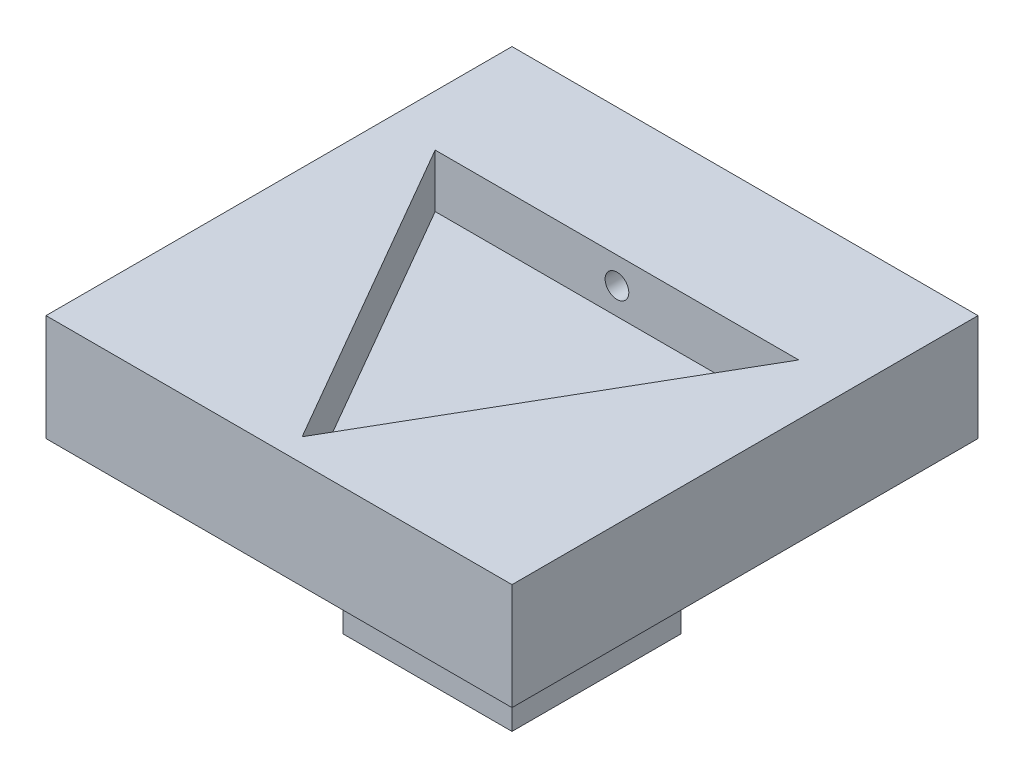
ISO-10303-21;
HEADER;
FILE_DESCRIPTION(('STEP AP214'),'2;1');
FILE_NAME('part.step','',(''),(''),'','','');
FILE_SCHEMA(('AUTOMOTIVE_DESIGN { 1 0 10303 214 1 1 1 1 }'));
ENDSEC;
DATA;
#1=APPLICATION_CONTEXT('core data for automotive mechanical design processes');
#2=APPLICATION_PROTOCOL_DEFINITION('international standard','automotive_design',2000,#1);
#3=PRODUCT_CONTEXT('',#1,'mechanical');
#4=PRODUCT('Part','Part','',(#3));
#5=PRODUCT_RELATED_PRODUCT_CATEGORY('part','',(#4));
#6=PRODUCT_DEFINITION_FORMATION('','',#4);
#7=PRODUCT_DEFINITION_CONTEXT('part definition',#1,'design');
#8=PRODUCT_DEFINITION('design','',#6,#7);
#9=PRODUCT_DEFINITION_SHAPE('','',#8);
#10=(LENGTH_UNIT() NAMED_UNIT(*) SI_UNIT(.MILLI.,.METRE.));
#11=(NAMED_UNIT(*) PLANE_ANGLE_UNIT() SI_UNIT($,.RADIAN.));
#12=(NAMED_UNIT(*) SI_UNIT($,.STERADIAN.) SOLID_ANGLE_UNIT());
#13=UNCERTAINTY_MEASURE_WITH_UNIT(LENGTH_MEASURE(1.E-05),#10,'distance_accuracy_value','');
#14=(GEOMETRIC_REPRESENTATION_CONTEXT(3) GLOBAL_UNCERTAINTY_ASSIGNED_CONTEXT((#13)) GLOBAL_UNIT_ASSIGNED_CONTEXT((#10,
#11,#12)) REPRESENTATION_CONTEXT('',''));
#15=CARTESIAN_POINT('',(0.,0.,0.));
#16=DIRECTION('',(0.,0.,1.));
#17=DIRECTION('',(1.,0.,0.));
#18=AXIS2_PLACEMENT_3D('',#15,#16,#17);
#19=CARTESIAN_POINT('',(0.,-6.35,6.35));
#20=DIRECTION('',(0.,0.,1.));
#21=DIRECTION('',(1.,0.,0.));
#22=AXIS2_PLACEMENT_3D('',#19,#20,#21);
#23=CYLINDRICAL_SURFACE('',#22,3.17499999999999);
#24=CARTESIAN_POINT('',(0.,-6.35,6.35));
#25=DIRECTION('',(0.,0.,1.));
#26=DIRECTION('',(1.,0.,0.));
#27=AXIS2_PLACEMENT_3D('',#24,#25,#26);
#28=CIRCLE('',#27,3.17499999999999);
#29=CARTESIAN_POINT('',(3.17499999999999,-6.35,6.35));
#30=VERTEX_POINT('',#29);
#31=EDGE_CURVE('E188',#30,#30,#28,.T.);
#32=ORIENTED_EDGE('',*,*,#31,.T.);
#33=EDGE_LOOP('',(#32));
#34=FACE_BOUND('',#33,.T.);
#35=CARTESIAN_POINT('',(0.,-9.52499999999999,-0.888999999999992));
#36=CARTESIAN_POINT('',(-0.0489157737538349,-9.52499936518856,-0.888999040755593));
#37=CARTESIAN_POINT('',(-0.0978415218299255,-9.52385856149938,-0.884949249649737));
#38=CARTESIAN_POINT('',(-0.194277613152042,-9.51941869982884,-0.868889515030162));
#39=CARTESIAN_POINT('',(-0.241787368037372,-9.51611875742133,-0.856876309517103));
#40=CARTESIAN_POINT('',(-0.333985970836094,-9.50772382932597,-0.825315435182667));
#41=CARTESIAN_POINT('',(-0.378678565700526,-9.50263128992257,-0.805778030929362));
#42=CARTESIAN_POINT('',(-0.464153150691927,-9.49118589033194,-0.759762993139136));
#43=CARTESIAN_POINT('',(-0.504934775786131,-9.48483291267041,-0.733284712630688));
#44=CARTESIAN_POINT('',(-0.582463324273018,-9.47136930906929,-0.673431529821144));
#45=CARTESIAN_POINT('',(-0.619097040879819,-9.46424471003711,-0.639913133891119));
#46=CARTESIAN_POINT('',(-0.686303745395539,-9.45012804899673,-0.567237555679335));
#47=CARTESIAN_POINT('',(-0.716875865353098,-9.44313600609849,-0.528079567256226));
#48=CARTESIAN_POINT('',(-0.771660273705076,-9.42993134711161,-0.444311833340359));
#49=CARTESIAN_POINT('',(-0.795739269537287,-9.42373626155938,-0.399611894550792));
#50=CARTESIAN_POINT('',(-0.83599419308683,-9.41303372841594,-0.306596224568229));
#51=CARTESIAN_POINT('',(-0.852171745640045,-9.4085259338984,-0.258281239124241));
#52=CARTESIAN_POINT('',(-0.875765553832272,-9.40185316306031,-0.160667772584882));
#53=CARTESIAN_POINT('',(-0.883388435468438,-9.39963304486603,-0.111423099155392));
#54=CARTESIAN_POINT('',(-0.890301136120377,-9.39762251150206,-0.0123076734273206));
#55=CARTESIAN_POINT('',(-0.889592686927827,-9.39783159138712,0.0375629466060269));
#56=CARTESIAN_POINT('',(-0.880026195745615,-9.40060666415035,0.134876354240687));
#57=CARTESIAN_POINT('',(-0.871421512477304,-9.4030993800786,0.182346475695469));
#58=CARTESIAN_POINT('',(-0.846713969112871,-9.41004305828935,0.275140646535334));
#59=CARTESIAN_POINT('',(-0.830610455225383,-9.4144941913161,0.320464508417443));
#60=CARTESIAN_POINT('',(-0.791163712285423,-9.42491527179748,0.408324147300476));
#61=CARTESIAN_POINT('',(-0.767734261578664,-9.43090314682857,0.450818996368115));
#62=CARTESIAN_POINT('',(-0.71436077007306,-9.44371379002513,0.53136139317462));
#63=CARTESIAN_POINT('',(-0.684415329838213,-9.45053673740076,0.569407982860276));
#64=CARTESIAN_POINT('',(-0.617578797379297,-9.46455075820432,0.641417476103654));
#65=CARTESIAN_POINT('',(-0.580475883052368,-9.471746226402,0.675183219833241));
#66=CARTESIAN_POINT('',(-0.501045351949352,-9.48547454789475,0.736055887562636));
#67=CARTESIAN_POINT('',(-0.458717485449023,-9.49200736949173,0.763162493106644));
#68=CARTESIAN_POINT('',(-0.36971285397413,-9.50372159534797,0.810046721230191));
#69=CARTESIAN_POINT('',(-0.323014650586869,-9.50889580695916,0.829785561102166));
#70=CARTESIAN_POINT('',(-0.226783977774734,-9.5172579589955,0.861073826594334));
#71=CARTESIAN_POINT('',(-0.177252196580579,-9.52044637951993,0.872625231761535));
#72=CARTESIAN_POINT('',(-0.0784404499677195,-9.52440379725835,0.886893968773622));
#73=CARTESIAN_POINT('',(-0.0292020197379107,-9.52524608915643,0.889879012949531));
#74=CARTESIAN_POINT('',(0.0690730306447958,-9.52462873659144,0.887673884327845));
#75=CARTESIAN_POINT('',(0.11810967332519,-9.52316935648366,0.882484650375492));
#76=CARTESIAN_POINT('',(0.213612420430054,-9.51816025342918,0.864296763280251));
#77=CARTESIAN_POINT('',(0.260109821187467,-9.51465126206611,0.851450184145278));
#78=CARTESIAN_POINT('',(0.350282967028205,-9.50594369765461,0.818491325090642));
#79=CARTESIAN_POINT('',(0.393958390904348,-9.50074493267499,0.798378219781215));
#80=CARTESIAN_POINT('',(0.478266796673957,-9.48906619959135,0.750979145328022));
#81=CARTESIAN_POINT('',(0.518816442059783,-9.48256157871768,0.72355117680334));
#82=CARTESIAN_POINT('',(0.594830571157073,-9.46902144731137,0.662477080624359));
#83=CARTESIAN_POINT('',(0.630293941475874,-9.46198582105379,0.628829595187419));
#84=CARTESIAN_POINT('',(0.696277111843979,-9.44790229776669,0.555018170335194));
#85=CARTESIAN_POINT('',(0.726607293994759,-9.4408609178264,0.514683143208387));
#86=CARTESIAN_POINT('',(0.780076249197734,-9.42780220325433,0.429344769891043));
#87=CARTESIAN_POINT('',(0.803215290960614,-9.42178483036237,0.384341598218469));
#88=CARTESIAN_POINT('',(0.841473857948888,-9.41152566127488,0.291144664224763));
#89=CARTESIAN_POINT('',(0.856637385143015,-9.4072741505467,0.242970094043794));
#90=CARTESIAN_POINT('',(0.878604076191613,-9.40103470564522,0.144613537966147));
#91=CARTESIAN_POINT('',(0.885409649014228,-9.39904611925357,0.0944321347958804));
#92=CARTESIAN_POINT('',(0.890318537347577,-9.39761603869309,-0.00456168626051117));
#93=CARTESIAN_POINT('',(0.888728204509423,-9.39808487304596,-0.0533578331874128));
#94=CARTESIAN_POINT('',(0.877609048522053,-9.40130466354991,-0.149956476607359));
#95=CARTESIAN_POINT('',(0.868080470943479,-9.40405554910543,-0.197759003791274));
#96=CARTESIAN_POINT('',(0.841541065868853,-9.4114733946758,-0.290583490313341));
#97=CARTESIAN_POINT('',(0.82460142237537,-9.41612209823446,-0.335627365346018));
#98=CARTESIAN_POINT('',(0.783775785662911,-9.42681065069981,-0.422268905257553));
#99=CARTESIAN_POINT('',(0.759888604353119,-9.43285073750866,-0.463865979138124));
#100=CARTESIAN_POINT('',(0.704944037229975,-9.44588424541817,-0.54387986720024));
#101=CARTESIAN_POINT('',(0.673680626237007,-9.45290209243823,-0.582151239273038));
#102=CARTESIAN_POINT('',(0.605254714532238,-9.46697124976765,-0.653003971391015));
#103=CARTESIAN_POINT('',(0.56809074717124,-9.4740225679728,-0.685583912527643));
#104=CARTESIAN_POINT('',(0.487828859115458,-9.48756945243036,-0.74491222597394));
#105=CARTESIAN_POINT('',(0.444608622335945,-9.4940473358147,-0.771499534501301));
#106=CARTESIAN_POINT('',(0.354130776281862,-9.50551736196214,-0.816990118054409));
#107=CARTESIAN_POINT('',(0.306875512094534,-9.51051036025106,-0.835897820039279));
#108=CARTESIAN_POINT('',(0.216568135388876,-9.51788227398237,-0.863320172720964));
#109=CARTESIAN_POINT('',(0.173866502868503,-9.52053098906547,-0.872926353200924));
#110=CARTESIAN_POINT('',(0.0874458203594981,-9.52409002955724,-0.885766306093223));
#111=CARTESIAN_POINT('',(0.0437268954046199,-9.52500056747201,-0.889000857489842));
#112=CARTESIAN_POINT('',(0.,-9.52499999999999,-0.888999999999992));
#113=B_SPLINE_CURVE_WITH_KNOTS('',3,(#35,#36,#37,#38,#39,#40,#41,#42,#43,#44,#45,#46,#47,#48,
#49,#50,#51,#52,#53,#54,#55,#56,#57,#58,#59,#60,#61,#62,#63,#64,#65,#66,#67,#68,#69,#70,#71,#72,
#73,#74,#75,#76,#77,#78,#79,#80,#81,#82,#83,#84,#85,#86,#87,#88,#89,#90,#91,#92,#93,#94,#95,#96,
#97,#98,#99,#100,#101,#102,#103,#104,#105,#106,#107,#108,#109,#110,#111,#112),.UNSPECIFIED.,.T.,
.F.,(4,2,2,2,2,2,2,2,2,2,2,2,2,2,2,2,2,2,2,2,2,2,2,2,2,2,2,2,2,2,2,2,2,2,2,2,2,2,4),(0.,
0.146586863750049,0.293233810016137,0.439681404062497,0.586142653608805,0.735943608929927,
0.885765998569633,1.03846326158801,1.1911291110338,1.34002235519436,1.48888465021512,
1.6331314778207,1.77739088405319,1.92341644964252,2.06947340808293,2.22080635932415,
2.37214654625826,2.52427248983089,2.67636164003823,2.82364307680308,2.97090759899851,
3.11534059337545,3.25978999875986,3.40727830060936,3.55479883873722,3.70693967387801,
3.85907482330245,4.01036157739037,4.16160471667115,4.30736828106396,4.45312733640924,
4.5975160871541,4.74192954419325,4.89099085253725,5.04008926990668,5.19281316203592,
5.34544889010499,5.47650216312912,5.60753941281356),.UNSPECIFIED.);
#114=CARTESIAN_POINT('',(-0.628617928474835,-9.46214789173008,0.628617928474835));
#115=VERTEX_POINT('',#114);
#116=CARTESIAN_POINT('',(0.628617928474841,-9.46214789173008,0.628617928474839));
#117=VERTEX_POINT('',#116);
#118=EDGE_CURVE('E145',#115,#117,#113,.T.);
#119=ORIENTED_EDGE('',*,*,#118,.F.);
#120=CARTESIAN_POINT('',(0.,-6.35,0.));
#121=DIRECTION('',(0.707106781186547,0.,0.707106781186547));
#122=DIRECTION('',(-0.707106781186547,0.,0.707106781186547));
#123=AXIS2_PLACEMENT_3D('',#120,#121,#122);
#124=ELLIPSE('',#123,4.49012806053456,3.17499999999999);
#125=CARTESIAN_POINT('',(0.,-3.17500000000001,0.));
#126=VERTEX_POINT('',#125);
#127=EDGE_CURVE('E43',#115,#126,#124,.F.);
#128=ORIENTED_EDGE('',*,*,#127,.T.);
#129=CARTESIAN_POINT('',(0.,-6.35,0.));
#130=DIRECTION('',(-0.707106781186547,0.,0.707106781186547));
#131=DIRECTION('',(0.707106781186547,0.,0.707106781186547));
#132=AXIS2_PLACEMENT_3D('',#129,#130,#131);
#133=ELLIPSE('',#132,4.49012806053456,3.17499999999999);
#134=EDGE_CURVE('E150',#126,#117,#133,.F.);
#135=ORIENTED_EDGE('',*,*,#134,.T.);
#136=EDGE_LOOP('',(#119,#128,#135));
#137=FACE_BOUND('',#136,.T.);
#138=ADVANCED_FACE('F31',(#34,#137),#23,.F.);
#139=CARTESIAN_POINT('',(17.5,0.,-17.5));
#140=DIRECTION('',(0.,-1.,0.));
#141=DIRECTION('',(0.,0.,-1.));
#142=AXIS2_PLACEMENT_3D('',#139,#140,#141);
#143=PLANE('',#142);
#144=DIRECTION('',(0.,0.,-1.));
#145=VECTOR('',#144,1.);
#146=CARTESIAN_POINT('',(17.5,0.,17.5));
#147=LINE('',#146,#145);
#148=CARTESIAN_POINT('',(17.5,0.,17.5));
#149=VERTEX_POINT('',#148);
#150=CARTESIAN_POINT('',(17.5,0.,-17.5));
#151=VERTEX_POINT('',#150);
#152=EDGE_CURVE('E245',#149,#151,#147,.T.);
#153=ORIENTED_EDGE('',*,*,#152,.F.);
#154=DIRECTION('',(1.,0.,0.));
#155=VECTOR('',#154,1.);
#156=CARTESIAN_POINT('',(-17.5,0.,17.5));
#157=LINE('',#156,#155);
#158=CARTESIAN_POINT('',(-17.5,0.,17.5));
#159=VERTEX_POINT('',#158);
#160=EDGE_CURVE('E254',#159,#149,#157,.T.);
#161=ORIENTED_EDGE('',*,*,#160,.F.);
#162=DIRECTION('',(0.,0.,1.));
#163=VECTOR('',#162,1.);
#164=CARTESIAN_POINT('',(-17.5,0.,17.5));
#165=LINE('',#164,#163);
#166=CARTESIAN_POINT('',(-17.5,0.,-17.5));
#167=VERTEX_POINT('',#166);
#168=EDGE_CURVE('E265',#167,#159,#165,.T.);
#169=ORIENTED_EDGE('',*,*,#168,.F.);
#170=DIRECTION('',(-1.,0.,0.));
#171=VECTOR('',#170,1.);
#172=CARTESIAN_POINT('',(-17.5,0.,-17.5));
#173=LINE('',#172,#171);
#174=EDGE_CURVE('E263',#151,#167,#173,.T.);
#175=ORIENTED_EDGE('',*,*,#174,.F.);
#176=EDGE_LOOP('',(#153,#161,#169,#175));
#177=FACE_BOUND('',#176,.T.);
#178=DIRECTION('',(-1.,0.,0.));
#179=VECTOR('',#178,1.);
#180=CARTESIAN_POINT('',(-6.35,0.,6.35));
#181=LINE('',#180,#179);
#182=CARTESIAN_POINT('',(6.35,0.,6.35));
#183=VERTEX_POINT('',#182);
#184=CARTESIAN_POINT('',(-6.35,0.,6.35));
#185=VERTEX_POINT('',#184);
#186=EDGE_CURVE('E206',#183,#185,#181,.T.);
#187=ORIENTED_EDGE('',*,*,#186,.F.);
#188=DIRECTION('',(0.,0.,1.));
#189=VECTOR('',#188,1.);
#190=CARTESIAN_POINT('',(6.35,0.,-6.35));
#191=LINE('',#190,#189);
#192=CARTESIAN_POINT('',(6.35,0.,-6.35));
#193=VERTEX_POINT('',#192);
#194=EDGE_CURVE('E203',#193,#183,#191,.T.);
#195=ORIENTED_EDGE('',*,*,#194,.F.);
#196=DIRECTION('',(1.,0.,0.));
#197=VECTOR('',#196,1.);
#198=CARTESIAN_POINT('',(-6.35,0.,-6.35));
#199=LINE('',#198,#197);
#200=CARTESIAN_POINT('',(-6.35,0.,-6.35));
#201=VERTEX_POINT('',#200);
#202=EDGE_CURVE('E196',#201,#193,#199,.T.);
#203=ORIENTED_EDGE('',*,*,#202,.F.);
#204=DIRECTION('',(0.,0.,-1.));
#205=VECTOR('',#204,1.);
#206=CARTESIAN_POINT('',(-6.35,0.,-6.35));
#207=LINE('',#206,#205);
#208=EDGE_CURVE('E208',#185,#201,#207,.T.);
#209=ORIENTED_EDGE('',*,*,#208,.F.);
#210=EDGE_LOOP('',(#187,#195,#203,#209));
#211=FACE_BOUND('',#210,.T.);
#212=ADVANCED_FACE('F293',(#177,#211),#143,.T.);
#213=CARTESIAN_POINT('',(-17.5,8.,-17.5));
#214=DIRECTION('',(0.,0.,1.));
#215=DIRECTION('',(1.,0.,0.));
#216=AXIS2_PLACEMENT_3D('',#213,#214,#215);
#217=PLANE('',#216);
#218=ORIENTED_EDGE('',*,*,#174,.T.);
#219=DIRECTION('',(0.,-1.,0.));
#220=VECTOR('',#219,1.);
#221=CARTESIAN_POINT('',(-17.5,8.,-17.5));
#222=LINE('',#221,#220);
#223=CARTESIAN_POINT('',(-17.5,8.,-17.5));
#224=VERTEX_POINT('',#223);
#225=EDGE_CURVE('E273',#224,#167,#222,.T.);
#226=ORIENTED_EDGE('',*,*,#225,.F.);
#227=DIRECTION('',(-1.,0.,0.));
#228=VECTOR('',#227,1.);
#229=CARTESIAN_POINT('',(-17.5,8.,-17.5));
#230=LINE('',#229,#228);
#231=CARTESIAN_POINT('',(17.5,8.,-17.5));
#232=VERTEX_POINT('',#231);
#233=EDGE_CURVE('E253',#232,#224,#230,.T.);
#234=ORIENTED_EDGE('',*,*,#233,.F.);
#235=DIRECTION('',(0.,-1.,0.));
#236=VECTOR('',#235,1.);
#237=CARTESIAN_POINT('',(17.5,8.,-17.5));
#238=LINE('',#237,#236);
#239=EDGE_CURVE('E154',#232,#151,#238,.T.);
#240=ORIENTED_EDGE('',*,*,#239,.T.);
#241=EDGE_LOOP('',(#218,#226,#234,#240));
#242=FACE_BOUND('',#241,.T.);
#243=CARTESIAN_POINT('',(0.,6.,-17.5));
#244=DIRECTION('',(0.,0.,-1.));
#245=DIRECTION('',(-1.,0.,0.));
#246=AXIS2_PLACEMENT_3D('',#243,#244,#245);
#247=CIRCLE('',#246,0.888999999999987);
#248=CARTESIAN_POINT('',(-0.888999999999987,6.,-17.5));
#249=VERTEX_POINT('',#248);
#250=EDGE_CURVE('E219',#249,#249,#247,.T.);
#251=ORIENTED_EDGE('',*,*,#250,.F.);
#252=EDGE_LOOP('',(#251));
#253=FACE_BOUND('',#252,.T.);
#254=ADVANCED_FACE('F298',(#242,#253),#217,.F.);
#255=CARTESIAN_POINT('',(17.5,8.,17.5));
#256=DIRECTION('',(-1.,0.,0.));
#257=DIRECTION('',(0.,0.,1.));
#258=AXIS2_PLACEMENT_3D('',#255,#256,#257);
#259=PLANE('',#258);
#260=ORIENTED_EDGE('',*,*,#152,.T.);
#261=ORIENTED_EDGE('',*,*,#239,.F.);
#262=DIRECTION('',(0.,0.,-1.));
#263=VECTOR('',#262,1.);
#264=CARTESIAN_POINT('',(17.5,8.,17.5));
#265=LINE('',#264,#263);
#266=CARTESIAN_POINT('',(17.5,8.,17.5));
#267=VERTEX_POINT('',#266);
#268=EDGE_CURVE('E250',#267,#232,#265,.T.);
#269=ORIENTED_EDGE('',*,*,#268,.F.);
#270=DIRECTION('',(0.,-1.,0.));
#271=VECTOR('',#270,1.);
#272=CARTESIAN_POINT('',(17.5,8.,17.5));
#273=LINE('',#272,#271);
#274=EDGE_CURVE('E260',#267,#149,#273,.T.);
#275=ORIENTED_EDGE('',*,*,#274,.T.);
#276=EDGE_LOOP('',(#260,#261,#269,#275));
#277=FACE_BOUND('',#276,.T.);
#278=ADVANCED_FACE('F361',(#277),#259,.F.);
#279=CARTESIAN_POINT('',(-17.5,8.,17.5));
#280=DIRECTION('',(1.,0.,0.));
#281=DIRECTION('',(0.,0.,-1.));
#282=AXIS2_PLACEMENT_3D('',#279,#280,#281);
#283=PLANE('',#282);
#284=ORIENTED_EDGE('',*,*,#168,.T.);
#285=DIRECTION('',(0.,-1.,0.));
#286=VECTOR('',#285,1.);
#287=CARTESIAN_POINT('',(-17.5,8.,17.5));
#288=LINE('',#287,#286);
#289=CARTESIAN_POINT('',(-17.5,8.,17.5));
#290=VERTEX_POINT('',#289);
#291=EDGE_CURVE('E270',#290,#159,#288,.T.);
#292=ORIENTED_EDGE('',*,*,#291,.F.);
#293=DIRECTION('',(0.,0.,1.));
#294=VECTOR('',#293,1.);
#295=CARTESIAN_POINT('',(-17.5,8.,17.5));
#296=LINE('',#295,#294);
#297=EDGE_CURVE('E256',#224,#290,#296,.T.);
#298=ORIENTED_EDGE('',*,*,#297,.F.);
#299=ORIENTED_EDGE('',*,*,#225,.T.);
#300=EDGE_LOOP('',(#284,#292,#298,#299));
#301=FACE_BOUND('',#300,.T.);
#302=ADVANCED_FACE('F357',(#301),#283,.F.);
#303=CARTESIAN_POINT('',(-17.5,8.,17.5));
#304=DIRECTION('',(0.,0.,-1.));
#305=DIRECTION('',(-1.,0.,0.));
#306=AXIS2_PLACEMENT_3D('',#303,#304,#305);
#307=PLANE('',#306);
#308=ORIENTED_EDGE('',*,*,#160,.T.);
#309=ORIENTED_EDGE('',*,*,#274,.F.);
#310=DIRECTION('',(1.,0.,0.));
#311=VECTOR('',#310,1.);
#312=CARTESIAN_POINT('',(-17.5,8.,17.5));
#313=LINE('',#312,#311);
#314=EDGE_CURVE('E258',#290,#267,#313,.T.);
#315=ORIENTED_EDGE('',*,*,#314,.F.);
#316=ORIENTED_EDGE('',*,*,#291,.T.);
#317=EDGE_LOOP('',(#308,#309,#315,#316));
#318=FACE_BOUND('',#317,.T.);
#319=ADVANCED_FACE('F352',(#318),#307,.F.);
#320=CARTESIAN_POINT('',(17.5,8.,-17.5));
#321=DIRECTION('',(0.,-1.,0.));
#322=DIRECTION('',(0.,0.,-1.));
#323=AXIS2_PLACEMENT_3D('',#320,#321,#322);
#324=PLANE('',#323);
#325=DIRECTION('',(0.500000000000099,0.,-0.866025403784381));
#326=VECTOR('',#325,1.);
#327=CARTESIAN_POINT('',(-1.80110809081765E-12,8.,15.7640191786544));
#328=LINE('',#327,#326);
#329=CARTESIAN_POINT('',(-1.80064296806393E-12,8.,15.7640191786544));
#330=VERTEX_POINT('',#329);
#331=CARTESIAN_POINT('',(13.6520410744607,8.,-7.88200958932565));
#332=VERTEX_POINT('',#331);
#333=EDGE_CURVE('E238',#330,#332,#328,.T.);
#334=ORIENTED_EDGE('',*,*,#333,.F.);
#335=DIRECTION('',(0.499999999999901,0.,0.866025403784496));
#336=VECTOR('',#335,1.);
#337=CARTESIAN_POINT('',(-13.6520410744589,8.,-7.88200958932876));
#338=LINE('',#337,#336);
#339=CARTESIAN_POINT('',(-13.6520410744589,8.,-7.88200958932876));
#340=VERTEX_POINT('',#339);
#341=EDGE_CURVE('E225',#340,#330,#338,.T.);
#342=ORIENTED_EDGE('',*,*,#341,.F.);
#343=DIRECTION('',(-1.,0.,-1.13915537444627E-13));
#344=VECTOR('',#343,1.);
#345=CARTESIAN_POINT('',(13.6520410744607,8.,-7.88200958932565));
#346=LINE('',#345,#344);
#347=EDGE_CURVE('E230',#332,#340,#346,.T.);
#348=ORIENTED_EDGE('',*,*,#347,.F.);
#349=EDGE_LOOP('',(#334,#342,#348));
#350=FACE_BOUND('',#349,.T.);
#351=ORIENTED_EDGE('',*,*,#268,.T.);
#352=ORIENTED_EDGE('',*,*,#233,.T.);
#353=ORIENTED_EDGE('',*,*,#297,.T.);
#354=ORIENTED_EDGE('',*,*,#314,.T.);
#355=EDGE_LOOP('',(#351,#352,#353,#354));
#356=FACE_BOUND('',#355,.T.);
#357=ADVANCED_FACE('F349',(#350,#356),#324,.F.);
#358=CARTESIAN_POINT('',(-13.6520410744589,4.,-7.88200958932876));
#359=DIRECTION('',(-0.866025403784496,0.,0.499999999999901));
#360=DIRECTION('',(0.499999999999901,0.,0.866025403784496));
#361=AXIS2_PLACEMENT_3D('',#358,#359,#360);
#362=PLANE('',#361);
#363=ORIENTED_EDGE('',*,*,#341,.T.);
#364=DIRECTION('',(0.,1.,0.));
#365=VECTOR('',#364,1.);
#366=CARTESIAN_POINT('',(-1.80110809081765E-12,4.,15.7640191786544));
#367=LINE('',#366,#365);
#368=CARTESIAN_POINT('',(-1.80110809081765E-12,4.,15.7640191786544));
#369=VERTEX_POINT('',#368);
#370=EDGE_CURVE('E236',#369,#330,#367,.T.);
#371=ORIENTED_EDGE('',*,*,#370,.F.);
#372=DIRECTION('',(0.499999999999901,0.,0.866025403784496));
#373=VECTOR('',#372,1.);
#374=CARTESIAN_POINT('',(-13.6520410744589,4.,-7.88200958932876));
#375=LINE('',#374,#373);
#376=CARTESIAN_POINT('',(-13.6520410744589,4.,-7.88200958932876));
#377=VERTEX_POINT('',#376);
#378=EDGE_CURVE('E226',#377,#369,#375,.T.);
#379=ORIENTED_EDGE('',*,*,#378,.F.);
#380=DIRECTION('',(0.,1.,0.));
#381=VECTOR('',#380,1.);
#382=CARTESIAN_POINT('',(-13.6520410744589,4.,-7.88200958932876));
#383=LINE('',#382,#381);
#384=EDGE_CURVE('E243',#377,#340,#383,.T.);
#385=ORIENTED_EDGE('',*,*,#384,.T.);
#386=EDGE_LOOP('',(#363,#371,#379,#385));
#387=FACE_BOUND('',#386,.T.);
#388=ADVANCED_FACE('F342',(#387),#362,.F.);
#389=CARTESIAN_POINT('',(13.6520410744607,4.,-7.88200958932565));
#390=DIRECTION('',(1.13915537444627E-13,0.,-1.));
#391=DIRECTION('',(-1.,0.,-1.13915537444627E-13));
#392=AXIS2_PLACEMENT_3D('',#389,#390,#391);
#393=PLANE('',#392);
#394=CARTESIAN_POINT('',(0.,6.,-7.8820095893272));
#395=DIRECTION('',(1.13915537444627E-13,0.,-1.));
#396=DIRECTION('',(-1.,0.,-1.13915537444627E-13));
#397=AXIS2_PLACEMENT_3D('',#394,#395,#396);
#398=CIRCLE('',#397,0.888999999999993);
#399=CARTESIAN_POINT('',(-0.888999999999993,6.,-7.8820095893273));
#400=VERTEX_POINT('',#399);
#401=EDGE_CURVE('E222',#400,#400,#398,.T.);
#402=ORIENTED_EDGE('',*,*,#401,.T.);
#403=EDGE_LOOP('',(#402));
#404=FACE_BOUND('',#403,.T.);
#405=ORIENTED_EDGE('',*,*,#347,.T.);
#406=ORIENTED_EDGE('',*,*,#384,.F.);
#407=DIRECTION('',(-1.,0.,-1.13915537444627E-13));
#408=VECTOR('',#407,1.);
#409=CARTESIAN_POINT('',(13.6520410744607,4.,-7.88200958932565));
#410=LINE('',#409,#408);
#411=CARTESIAN_POINT('',(13.6520410744607,4.,-7.88200958932565));
#412=VERTEX_POINT('',#411);
#413=EDGE_CURVE('E233',#412,#377,#410,.T.);
#414=ORIENTED_EDGE('',*,*,#413,.F.);
#415=DIRECTION('',(0.,1.,0.));
#416=VECTOR('',#415,1.);
#417=CARTESIAN_POINT('',(13.6520410744607,4.,-7.88200958932565));
#418=LINE('',#417,#416);
#419=EDGE_CURVE('E246',#412,#332,#418,.T.);
#420=ORIENTED_EDGE('',*,*,#419,.T.);
#421=EDGE_LOOP('',(#405,#406,#414,#420));
#422=FACE_BOUND('',#421,.T.);
#423=ADVANCED_FACE('F339',(#404,#422),#393,.F.);
#424=CARTESIAN_POINT('',(-1.80110809081765E-12,4.,15.7640191786544));
#425=DIRECTION('',(0.866025403784381,0.,0.500000000000099));
#426=DIRECTION('',(0.500000000000099,0.,-0.866025403784382));
#427=AXIS2_PLACEMENT_3D('',#424,#425,#426);
#428=PLANE('',#427);
#429=ORIENTED_EDGE('',*,*,#333,.T.);
#430=ORIENTED_EDGE('',*,*,#419,.F.);
#431=DIRECTION('',(0.500000000000099,0.,-0.866025403784381));
#432=VECTOR('',#431,1.);
#433=CARTESIAN_POINT('',(-1.80110809081765E-12,4.,15.7640191786544));
#434=LINE('',#433,#432);
#435=EDGE_CURVE('E229',#369,#412,#434,.T.);
#436=ORIENTED_EDGE('',*,*,#435,.F.);
#437=ORIENTED_EDGE('',*,*,#370,.T.);
#438=EDGE_LOOP('',(#429,#430,#436,#437));
#439=FACE_BOUND('',#438,.T.);
#440=ADVANCED_FACE('F337',(#439),#428,.F.);
#441=CARTESIAN_POINT('',(-1.80206044385896E-12,4.,15.7640191786544));
#442=DIRECTION('',(0.,1.,0.));
#443=DIRECTION('',(0.,0.,1.));
#444=AXIS2_PLACEMENT_3D('',#441,#442,#443);
#445=PLANE('',#444);
#446=ORIENTED_EDGE('',*,*,#378,.T.);
#447=ORIENTED_EDGE('',*,*,#435,.T.);
#448=ORIENTED_EDGE('',*,*,#413,.T.);
#449=EDGE_LOOP('',(#446,#447,#448));
#450=FACE_BOUND('',#449,.T.);
#451=ADVANCED_FACE('F329',(#450),#445,.T.);
#452=CARTESIAN_POINT('',(0.,6.,-17.5));
#453=DIRECTION('',(0.,0.,-1.));
#454=DIRECTION('',(-1.,0.,0.));
#455=AXIS2_PLACEMENT_3D('',#452,#453,#454);
#456=CYLINDRICAL_SURFACE('',#455,0.888999999999993);
#457=ORIENTED_EDGE('',*,*,#401,.F.);
#458=EDGE_LOOP('',(#457));
#459=FACE_BOUND('',#458,.T.);
#460=ORIENTED_EDGE('',*,*,#250,.T.);
#461=EDGE_LOOP('',(#460));
#462=FACE_BOUND('',#461,.T.);
#463=ADVANCED_FACE('F323',(#459,#462),#456,.F.);
#464=CARTESIAN_POINT('',(6.35,-12.7,-6.35));
#465=DIRECTION('',(-1.,0.,0.));
#466=DIRECTION('',(0.,0.,1.));
#467=AXIS2_PLACEMENT_3D('',#464,#465,#466);
#468=PLANE('',#467);
#469=CARTESIAN_POINT('',(6.35,-6.35,0.));
#470=DIRECTION('',(1.,0.,0.));
#471=DIRECTION('',(0.,0.,-1.));
#472=AXIS2_PLACEMENT_3D('',#469,#470,#471);
#473=CIRCLE('',#472,3.17499999999999);
#474=CARTESIAN_POINT('',(6.35,-6.35,-3.17499999999999));
#475=VERTEX_POINT('',#474);
#476=EDGE_CURVE('E182',#475,#475,#473,.T.);
#477=ORIENTED_EDGE('',*,*,#476,.F.);
#478=EDGE_LOOP('',(#477));
#479=FACE_BOUND('',#478,.T.);
#480=ORIENTED_EDGE('',*,*,#194,.T.);
#481=DIRECTION('',(0.,1.,0.));
#482=VECTOR('',#481,1.);
#483=CARTESIAN_POINT('',(6.35,-12.7,6.35));
#484=LINE('',#483,#482);
#485=CARTESIAN_POINT('',(6.35,-12.7,6.35));
#486=VERTEX_POINT('',#485);
#487=EDGE_CURVE('E217',#486,#183,#484,.T.);
#488=ORIENTED_EDGE('',*,*,#487,.F.);
#489=DIRECTION('',(0.,0.,1.));
#490=VECTOR('',#489,1.);
#491=CARTESIAN_POINT('',(6.35,-12.7,-6.35));
#492=LINE('',#491,#490);
#493=CARTESIAN_POINT('',(6.35,-12.7,-6.35));
#494=VERTEX_POINT('',#493);
#495=EDGE_CURVE('E192',#494,#486,#492,.T.);
#496=ORIENTED_EDGE('',*,*,#495,.F.);
#497=DIRECTION('',(0.,1.,0.));
#498=VECTOR('',#497,1.);
#499=CARTESIAN_POINT('',(6.35,-12.7,-6.35));
#500=LINE('',#499,#498);
#501=EDGE_CURVE('E202',#494,#193,#500,.T.);
#502=ORIENTED_EDGE('',*,*,#501,.T.);
#503=EDGE_LOOP('',(#480,#488,#496,#502));
#504=FACE_BOUND('',#503,.T.);
#505=ADVANCED_FACE('F307',(#479,#504),#468,.F.);
#506=CARTESIAN_POINT('',(-6.35,-12.7,6.35));
#507=DIRECTION('',(0.,0.,-1.));
#508=DIRECTION('',(-1.,0.,0.));
#509=AXIS2_PLACEMENT_3D('',#506,#507,#508);
#510=PLANE('',#509);
#511=ORIENTED_EDGE('',*,*,#31,.F.);
#512=EDGE_LOOP('',(#511));
#513=FACE_BOUND('',#512,.T.);
#514=ORIENTED_EDGE('',*,*,#186,.T.);
#515=DIRECTION('',(0.,1.,0.));
#516=VECTOR('',#515,1.);
#517=CARTESIAN_POINT('',(-6.35,-12.7,6.35));
#518=LINE('',#517,#516);
#519=CARTESIAN_POINT('',(-6.35,-12.7,6.35));
#520=VERTEX_POINT('',#519);
#521=EDGE_CURVE('E214',#520,#185,#518,.T.);
#522=ORIENTED_EDGE('',*,*,#521,.F.);
#523=DIRECTION('',(-1.,0.,0.));
#524=VECTOR('',#523,1.);
#525=CARTESIAN_POINT('',(-6.35,-12.7,6.35));
#526=LINE('',#525,#524);
#527=EDGE_CURVE('E195',#486,#520,#526,.T.);
#528=ORIENTED_EDGE('',*,*,#527,.F.);
#529=ORIENTED_EDGE('',*,*,#487,.T.);
#530=EDGE_LOOP('',(#514,#522,#528,#529));
#531=FACE_BOUND('',#530,.T.);
#532=ADVANCED_FACE('F303',(#513,#531),#510,.F.);
#533=CARTESIAN_POINT('',(-6.35,-12.7,-6.35));
#534=DIRECTION('',(1.,0.,0.));
#535=DIRECTION('',(0.,0.,-1.));
#536=AXIS2_PLACEMENT_3D('',#533,#534,#535);
#537=PLANE('',#536);
#538=CARTESIAN_POINT('',(-6.35,-6.35,0.));
#539=DIRECTION('',(1.,0.,0.));
#540=DIRECTION('',(0.,0.,-1.));
#541=AXIS2_PLACEMENT_3D('',#538,#539,#540);
#542=CIRCLE('',#541,3.17499999999999);
#543=CARTESIAN_POINT('',(-6.35,-6.35,-3.17499999999999));
#544=VERTEX_POINT('',#543);
#545=EDGE_CURVE('E185',#544,#544,#542,.T.);
#546=ORIENTED_EDGE('',*,*,#545,.T.);
#547=EDGE_LOOP('',(#546));
#548=FACE_BOUND('',#547,.T.);
#549=ORIENTED_EDGE('',*,*,#208,.T.);
#550=DIRECTION('',(0.,1.,0.));
#551=VECTOR('',#550,1.);
#552=CARTESIAN_POINT('',(-6.35,-12.7,-6.35));
#553=LINE('',#552,#551);
#554=CARTESIAN_POINT('',(-6.35,-12.7,-6.35));
#555=VERTEX_POINT('',#554);
#556=EDGE_CURVE('E57',#555,#201,#553,.T.);
#557=ORIENTED_EDGE('',*,*,#556,.F.);
#558=DIRECTION('',(0.,0.,-1.));
#559=VECTOR('',#558,1.);
#560=CARTESIAN_POINT('',(-6.35,-12.7,-6.35));
#561=LINE('',#560,#559);
#562=EDGE_CURVE('E198',#520,#555,#561,.T.);
#563=ORIENTED_EDGE('',*,*,#562,.F.);
#564=ORIENTED_EDGE('',*,*,#521,.T.);
#565=EDGE_LOOP('',(#549,#557,#563,#564));
#566=FACE_BOUND('',#565,.T.);
#567=ADVANCED_FACE('F306',(#548,#566),#537,.F.);
#568=CARTESIAN_POINT('',(-6.35,-12.7,-6.35));
#569=DIRECTION('',(0.,0.,1.));
#570=DIRECTION('',(1.,0.,0.));
#571=AXIS2_PLACEMENT_3D('',#568,#569,#570);
#572=PLANE('',#571);
#573=CARTESIAN_POINT('',(0.,-6.35,-6.35));
#574=DIRECTION('',(0.,0.,1.));
#575=DIRECTION('',(1.,0.,0.));
#576=AXIS2_PLACEMENT_3D('',#573,#574,#575);
#577=CIRCLE('',#576,3.17499999999999);
#578=CARTESIAN_POINT('',(3.17499999999999,-6.35,-6.35));
#579=VERTEX_POINT('',#578);
#580=EDGE_CURVE('E191',#579,#579,#577,.T.);
#581=ORIENTED_EDGE('',*,*,#580,.T.);
#582=EDGE_LOOP('',(#581));
#583=FACE_BOUND('',#582,.T.);
#584=ORIENTED_EDGE('',*,*,#202,.T.);
#585=ORIENTED_EDGE('',*,*,#501,.F.);
#586=DIRECTION('',(1.,0.,0.));
#587=VECTOR('',#586,1.);
#588=CARTESIAN_POINT('',(-6.35,-12.7,-6.35));
#589=LINE('',#588,#587);
#590=EDGE_CURVE('E200',#555,#494,#589,.T.);
#591=ORIENTED_EDGE('',*,*,#590,.F.);
#592=ORIENTED_EDGE('',*,*,#556,.T.);
#593=EDGE_LOOP('',(#584,#585,#591,#592));
#594=FACE_BOUND('',#593,.T.);
#595=ADVANCED_FACE('F280',(#583,#594),#572,.F.);
#596=CARTESIAN_POINT('',(6.35,-12.7,6.35));
#597=DIRECTION('',(0.,1.,0.));
#598=DIRECTION('',(0.,0.,1.));
#599=AXIS2_PLACEMENT_3D('',#596,#597,#598);
#600=PLANE('',#599);
#601=CARTESIAN_POINT('',(0.,-12.7,0.));
#602=DIRECTION('',(0.,-1.,0.));
#603=DIRECTION('',(0.,0.,-1.));
#604=AXIS2_PLACEMENT_3D('',#601,#602,#603);
#605=CIRCLE('',#604,0.888999999999987);
#606=CARTESIAN_POINT('',(0.,-12.7,-0.888999999999986));
#607=VERTEX_POINT('',#606);
#608=EDGE_CURVE('E158',#607,#607,#605,.T.);
#609=ORIENTED_EDGE('',*,*,#608,.F.);
#610=EDGE_LOOP('',(#609));
#611=FACE_BOUND('',#610,.T.);
#612=ORIENTED_EDGE('',*,*,#495,.T.);
#613=ORIENTED_EDGE('',*,*,#527,.T.);
#614=ORIENTED_EDGE('',*,*,#562,.T.);
#615=ORIENTED_EDGE('',*,*,#590,.T.);
#616=EDGE_LOOP('',(#612,#613,#614,#615));
#617=FACE_BOUND('',#616,.T.);
#618=ADVANCED_FACE('F283',(#611,#617),#600,.F.);
#619=CARTESIAN_POINT('',(0.,-6.35,0.));
#620=DIRECTION('',(-0.707106781186547,0.,0.707106781186547));
#621=DIRECTION('',(0.707106781186547,0.,0.707106781186547));
#622=AXIS2_PLACEMENT_3D('',#619,#620,#621);
#623=ELLIPSE('',#622,4.49012806053456,3.17499999999999);
#624=CARTESIAN_POINT('',(-0.628617928474834,-9.46214789173008,-0.628617928474834));
#625=VERTEX_POINT('',#624);
#626=EDGE_CURVE('E143',#126,#625,#623,.T.);
#627=ORIENTED_EDGE('',*,*,#626,.T.);
#628=CARTESIAN_POINT('',(-0.888183196193209,-9.39823811569896,0.0381000000000001));
#629=CARTESIAN_POINT('',(-0.889228959183822,-9.3979316502638,0.0137307908342314));
#630=CARTESIAN_POINT('',(-0.889269961063558,-9.39792107034415,-0.0106733120385726));
#631=CARTESIAN_POINT('',(-0.887348989734996,-9.3984815661019,-0.0593916830699045));
#632=CARTESIAN_POINT('',(-0.885387361310629,-9.39905254165544,-0.0837059659691493));
#633=CARTESIAN_POINT('',(-0.876527106827733,-9.40161720647784,-0.156134189354517));
#634=CARTESIAN_POINT('',(-0.866659608781869,-9.40446083334722,-0.203889736062175));
#635=CARTESIAN_POINT('',(-0.839335755098144,-9.4120806583201,-0.296973336515223));
#636=CARTESIAN_POINT('',(-0.821880293658366,-9.41685662870338,-0.342301675586422));
#637=CARTESIAN_POINT('',(-0.779917916339699,-9.42779490683757,-0.429401955533549));
#638=CARTESIAN_POINT('',(-0.755408553743017,-9.43395769545851,-0.471172655879879));
#639=CARTESIAN_POINT('',(-0.699367223068337,-9.44715286535997,-0.551037070351554));
#640=CARTESIAN_POINT('',(-0.667684952694141,-9.45420216059852,-0.589022451515991));
#641=CARTESIAN_POINT('',(-0.598464856988315,-9.46828646208039,-0.659235798872354));
#642=CARTESIAN_POINT('',(-0.560925788445953,-9.47532146496799,-0.691462539566307));
#643=CARTESIAN_POINT('',(-0.480001921406254,-9.48878024659261,-0.749979369263617));
#644=CARTESIAN_POINT('',(-0.436501752464684,-9.49518606879457,-0.776114464544627));
#645=CARTESIAN_POINT('',(-0.345532237239868,-9.50647425537639,-0.820665682942689));
#646=CARTESIAN_POINT('',(-0.298063689712924,-9.51135692540508,-0.839083354959208));
#647=CARTESIAN_POINT('',(-0.201521802331131,-9.51896023822589,-0.867286895331048));
#648=CARTESIAN_POINT('',(-0.152501349612549,-9.52172317285988,-0.87724206486961));
#649=CARTESIAN_POINT('',(-0.0534133309315235,-9.52493729901471,-0.888793932712006));
#650=CARTESIAN_POINT('',(-0.00334596226659891,-9.52538892224288,-0.89039219192294));
#651=CARTESIAN_POINT('',(0.0947726702403016,-9.52395304177137,-0.885256268317504));
#652=CARTESIAN_POINT('',(0.142838583201643,-9.52213704848582,-0.87877682996734));
#653=CARTESIAN_POINT('',(0.237164721569786,-9.51648247697705,-0.858140407087688));
#654=CARTESIAN_POINT('',(0.283424929865833,-9.51264387959275,-0.843983349824443));
#655=CARTESIAN_POINT('',(0.373119736870211,-9.50332391399208,-0.808358370981604));
#656=CARTESIAN_POINT('',(0.41653932832009,-9.49783456337245,-0.786854854412874));
#657=CARTESIAN_POINT('',(0.499217269369167,-9.48578619663414,-0.73717724966738));
#658=CARTESIAN_POINT('',(0.538474664518665,-9.47922693604179,-0.709001636254802));
#659=CARTESIAN_POINT('',(0.613105448395479,-9.46548001493393,-0.64567537564771));
#660=CARTESIAN_POINT('',(0.648305704170909,-9.45827869444793,-0.610323496922467));
#661=CARTESIAN_POINT('',(0.712344597073308,-9.44423134259068,-0.534191578455175));
#662=CARTESIAN_POINT('',(0.74118232915653,-9.43738536187089,-0.493410767790248));
#663=CARTESIAN_POINT('',(0.792038999214233,-9.42473542229853,-0.406876312208448));
#664=CARTESIAN_POINT('',(0.813959117355048,-9.41894702241942,-0.361062198780872));
#665=CARTESIAN_POINT('',(0.849715627277611,-9.40924082872512,-0.266209952279374));
#666=CARTESIAN_POINT('',(0.863558817668495,-9.4053214621938,-0.217174569449847));
#667=CARTESIAN_POINT('',(0.879590057728402,-9.40073633326754,-0.133515651688488));
#668=CARTESIAN_POINT('',(0.884098723199335,-9.39942849339762,-0.0993545047256207));
#669=CARTESIAN_POINT('',(0.889135654296133,-9.39795946031221,-0.0307371511104889));
#670=CARTESIAN_POINT('',(0.889666339494536,-9.39779757008597,0.00371886341943384));
#671=CARTESIAN_POINT('',(0.888183196193212,-9.39823811569896,0.0381000000000001));
#672=B_SPLINE_CURVE_WITH_KNOTS('',3,(#628,#629,#630,#631,#632,#633,#634,#635,#636,#637,#638,
#639,#640,#641,#642,#643,#644,#645,#646,#647,#648,#649,#650,#651,#652,#653,#654,#655,#656,#657,
#658,#659,#660,#661,#662,#663,#664,#665,#666,#667,#668,#669,#670,#671),.UNSPECIFIED.,.F.,.F.,(4,
2,2,2,2,2,2,2,2,2,2,2,2,2,2,2,2,2,2,2,2,4),(0.,0.073134712410827,0.146256835667354,
0.292038103463409,0.437802196426109,0.583616910216336,0.732828647523145,0.882072100904732,
1.03477634927962,1.18744993496555,1.33699198246096,1.48650609743406,1.6314220518422,
1.77633937913248,1.92196905765639,2.06763205919643,2.21815154138856,2.36869242059544,
2.52129550805106,2.67376995858878,2.776981014008,2.88012928708607),.UNSPECIFIED.);
#673=CARTESIAN_POINT('',(0.628617928474836,-9.46214789173008,-0.628617928474836));
#674=VERTEX_POINT('',#673);
#675=EDGE_CURVE('E11',#625,#674,#672,.T.);
#676=ORIENTED_EDGE('',*,*,#675,.T.);
#677=CARTESIAN_POINT('',(0.,-6.35,0.));
#678=DIRECTION('',(0.707106781186547,0.,0.707106781186547));
#679=DIRECTION('',(-0.707106781186547,0.,0.707106781186547));
#680=AXIS2_PLACEMENT_3D('',#677,#678,#679);
#681=ELLIPSE('',#680,4.49012806053456,3.17499999999999);
#682=EDGE_CURVE('E149',#674,#126,#681,.T.);
#683=ORIENTED_EDGE('',*,*,#682,.T.);
#684=EDGE_LOOP('',(#627,#676,#683));
#685=FACE_BOUND('',#684,.T.);
#686=ORIENTED_EDGE('',*,*,#580,.F.);
#687=EDGE_LOOP('',(#686));
#688=FACE_BOUND('',#687,.T.);
#689=ADVANCED_FACE('F147',(#685,#688),#23,.F.);
#690=CARTESIAN_POINT('',(6.35,-6.35,0.));
#691=DIRECTION('',(1.,0.,0.));
#692=DIRECTION('',(0.,0.,-1.));
#693=AXIS2_PLACEMENT_3D('',#690,#691,#692);
#694=CYLINDRICAL_SURFACE('',#693,3.17499999999999);
#695=ORIENTED_EDGE('',*,*,#476,.T.);
#696=EDGE_LOOP('',(#695));
#697=FACE_BOUND('',#696,.T.);
#698=ORIENTED_EDGE('',*,*,#682,.F.);
#699=CARTESIAN_POINT('',(-0.0381000000000001,-9.39823811569896,-0.88818319619321));
#700=CARTESIAN_POINT('',(-0.0137307908342314,-9.3979316502638,-0.889228959183823));
#701=CARTESIAN_POINT('',(0.0106733120385727,-9.39792107034415,-0.889269961063558));
#702=CARTESIAN_POINT('',(0.0593916830699046,-9.3984815661019,-0.887348989734997));
#703=CARTESIAN_POINT('',(0.0837059659691494,-9.39905254165544,-0.88538736131063));
#704=CARTESIAN_POINT('',(0.156134189354517,-9.40161720647784,-0.876527106827734));
#705=CARTESIAN_POINT('',(0.203889736062175,-9.40446083334722,-0.866659608781871));
#706=CARTESIAN_POINT('',(0.296973336515223,-9.4120806583201,-0.839335755098145));
#707=CARTESIAN_POINT('',(0.342301675586422,-9.41685662870338,-0.821880293658368));
#708=CARTESIAN_POINT('',(0.42940195553355,-9.42779490683757,-0.779917916339701));
#709=CARTESIAN_POINT('',(0.471172655879879,-9.43395769545851,-0.755408553743019));
#710=CARTESIAN_POINT('',(0.551037070351555,-9.44715286535997,-0.69936722306834));
#711=CARTESIAN_POINT('',(0.589022451515991,-9.45420216059852,-0.667684952694143));
#712=CARTESIAN_POINT('',(0.659235798872355,-9.46828646208039,-0.598464856988318));
#713=CARTESIAN_POINT('',(0.691462539566308,-9.47532146496799,-0.560925788445956));
#714=CARTESIAN_POINT('',(0.749979369263619,-9.48878024659261,-0.480001921406257));
#715=CARTESIAN_POINT('',(0.776114464544628,-9.49518606879457,-0.436501752464687));
#716=CARTESIAN_POINT('',(0.820665682942691,-9.50647425537639,-0.345532237239871));
#717=CARTESIAN_POINT('',(0.839083354959209,-9.51135692540508,-0.298063689712927));
#718=CARTESIAN_POINT('',(0.86728689533105,-9.51896023822589,-0.201521802331134));
#719=CARTESIAN_POINT('',(0.877242064869612,-9.52172317285988,-0.152501349612553));
#720=CARTESIAN_POINT('',(0.888793932712008,-9.52493729901471,-0.0534133309315269));
#721=CARTESIAN_POINT('',(0.890392191922943,-9.52538892224288,-0.00334596226660231));
#722=CARTESIAN_POINT('',(0.885256268317507,-9.52395304177137,0.0947726702402982));
#723=CARTESIAN_POINT('',(0.878776829967343,-9.52213704848582,0.142838583201639));
#724=CARTESIAN_POINT('',(0.858140407087691,-9.51648247697705,0.237164721569782));
#725=CARTESIAN_POINT('',(0.843983349824447,-9.51264387959275,0.283424929865829));
#726=CARTESIAN_POINT('',(0.808358370981608,-9.50332391399208,0.373119736870208));
#727=CARTESIAN_POINT('',(0.786854854412878,-9.49783456337245,0.416539328320087));
#728=CARTESIAN_POINT('',(0.737177249667385,-9.48578619663414,0.499217269369163));
#729=CARTESIAN_POINT('',(0.709001636254806,-9.47922693604179,0.538474664518662));
#730=CARTESIAN_POINT('',(0.645675375647715,-9.46548001493393,0.613105448395476));
#731=CARTESIAN_POINT('',(0.610323496922472,-9.45827869444793,0.648305704170906));
#732=CARTESIAN_POINT('',(0.53419157845518,-9.44423134259068,0.712344597073305));
#733=CARTESIAN_POINT('',(0.493410767790253,-9.43738536187089,0.741182329156528));
#734=CARTESIAN_POINT('',(0.406876312208452,-9.42473542229853,0.792038999214231));
#735=CARTESIAN_POINT('',(0.361062198780877,-9.41894702241942,0.813959117355046));
#736=CARTESIAN_POINT('',(0.266209952279379,-9.40924082872512,0.849715627277609));
#737=CARTESIAN_POINT('',(0.217174569449852,-9.4053214621938,0.863558817668493));
#738=CARTESIAN_POINT('',(0.133515651688492,-9.40073633326754,0.879590057728401));
#739=CARTESIAN_POINT('',(0.0993545047256243,-9.39942849339762,0.884098723199334));
#740=CARTESIAN_POINT('',(0.0307371511104908,-9.39795946031221,0.889135654296132));
#741=CARTESIAN_POINT('',(-0.00371886341943285,-9.39779757008597,0.889666339494536));
#742=CARTESIAN_POINT('',(-0.0381000000000001,-9.39823811569896,0.888183196193211));
#743=B_SPLINE_CURVE_WITH_KNOTS('',3,(#699,#700,#701,#702,#703,#704,#705,#706,#707,#708,#709,
#710,#711,#712,#713,#714,#715,#716,#717,#718,#719,#720,#721,#722,#723,#724,#725,#726,#727,#728,
#729,#730,#731,#732,#733,#734,#735,#736,#737,#738,#739,#740,#741,#742),.UNSPECIFIED.,.F.,.F.,(4,
2,2,2,2,2,2,2,2,2,2,2,2,2,2,2,2,2,2,2,2,4),(0.,0.0731347124108271,0.146256835667354,
0.292038103463409,0.437802196426109,0.583616910216336,0.732828647523145,0.882072100904732,
1.03477634927962,1.18744993496555,1.33699198246096,1.48650609743406,1.6314220518422,
1.77633937913248,1.92196905765639,2.06763205919643,2.21815154138856,2.36869242059544,
2.52129550805106,2.67376995858877,2.77698101400801,2.88012928708607),.UNSPECIFIED.);
#744=EDGE_CURVE('E50',#674,#117,#743,.T.);
#745=ORIENTED_EDGE('',*,*,#744,.T.);
#746=ORIENTED_EDGE('',*,*,#134,.F.);
#747=EDGE_LOOP('',(#698,#745,#746));
#748=FACE_BOUND('',#747,.T.);
#749=ADVANCED_FACE('F282',(#697,#748),#694,.F.);
#750=ORIENTED_EDGE('',*,*,#127,.F.);
#751=CARTESIAN_POINT('',(0.0381000000000001,-9.39823811569896,0.888183196193211));
#752=CARTESIAN_POINT('',(0.0137307908342314,-9.3979316502638,0.889228959183825));
#753=CARTESIAN_POINT('',(-0.0106733120385726,-9.39792107034415,0.88926996106356));
#754=CARTESIAN_POINT('',(-0.0593916830699045,-9.3984815661019,0.887348989734998));
#755=CARTESIAN_POINT('',(-0.0837059659691493,-9.39905254165544,0.885387361310632));
#756=CARTESIAN_POINT('',(-0.156134189354517,-9.40161720647784,0.876527106827735));
#757=CARTESIAN_POINT('',(-0.203889736062175,-9.40446083334722,0.866659608781872));
#758=CARTESIAN_POINT('',(-0.296973336515223,-9.4120806583201,0.839335755098146));
#759=CARTESIAN_POINT('',(-0.342301675586422,-9.41685662870338,0.821880293658369));
#760=CARTESIAN_POINT('',(-0.429401955533549,-9.42779490683757,0.779917916339701));
#761=CARTESIAN_POINT('',(-0.471172655879879,-9.43395769545851,0.755408553743019));
#762=CARTESIAN_POINT('',(-0.551037070351554,-9.44715286535997,0.699367223068339));
#763=CARTESIAN_POINT('',(-0.58902245151599,-9.45420216059852,0.667684952694143));
#764=CARTESIAN_POINT('',(-0.659235798872354,-9.46828646208039,0.598464856988317));
#765=CARTESIAN_POINT('',(-0.691462539566307,-9.47532146496799,0.560925788445955));
#766=CARTESIAN_POINT('',(-0.749979369263617,-9.48878024659261,0.480001921406256));
#767=CARTESIAN_POINT('',(-0.776114464544627,-9.49518606879457,0.436501752464686));
#768=CARTESIAN_POINT('',(-0.820665682942689,-9.50647425537639,0.345532237239869));
#769=CARTESIAN_POINT('',(-0.839083354959207,-9.51135692540508,0.298063689712925));
#770=CARTESIAN_POINT('',(-0.867286895331047,-9.51896023822589,0.201521802331132));
#771=CARTESIAN_POINT('',(-0.87724206486961,-9.52172317285988,0.152501349612551));
#772=CARTESIAN_POINT('',(-0.888793932712005,-9.52493729901471,0.0534133309315248));
#773=CARTESIAN_POINT('',(-0.890392191922939,-9.52538892224288,0.00334596226660019));
#774=CARTESIAN_POINT('',(-0.885256268317503,-9.52395304177137,-0.0947726702403003));
#775=CARTESIAN_POINT('',(-0.878776829967339,-9.52213704848582,-0.142838583201641));
#776=CARTESIAN_POINT('',(-0.858140407087687,-9.51648247697705,-0.237164721569784));
#777=CARTESIAN_POINT('',(-0.843983349824442,-9.51264387959275,-0.283424929865831));
#778=CARTESIAN_POINT('',(-0.808358370981603,-9.50332391399208,-0.37311973687021));
#779=CARTESIAN_POINT('',(-0.786854854412873,-9.49783456337245,-0.416539328320088));
#780=CARTESIAN_POINT('',(-0.737177249667379,-9.48578619663414,-0.499217269369165));
#781=CARTESIAN_POINT('',(-0.7090016362548,-9.47922693604179,-0.538474664518664));
#782=CARTESIAN_POINT('',(-0.645675375647709,-9.46548001493393,-0.613105448395477));
#783=CARTESIAN_POINT('',(-0.610323496922465,-9.45827869444793,-0.648305704170907));
#784=CARTESIAN_POINT('',(-0.534191578455173,-9.44423134259068,-0.712344597073306));
#785=CARTESIAN_POINT('',(-0.493410767790246,-9.43738536187089,-0.741182329156529));
#786=CARTESIAN_POINT('',(-0.406876312208445,-9.42473542229853,-0.792038999214231));
#787=CARTESIAN_POINT('',(-0.36106219878087,-9.41894702241942,-0.813959117355046));
#788=CARTESIAN_POINT('',(-0.266209952279372,-9.40924082872512,-0.849715627277609));
#789=CARTESIAN_POINT('',(-0.217174569449845,-9.4053214621938,-0.863558817668492));
#790=CARTESIAN_POINT('',(-0.133515651688486,-9.40073633326754,-0.8795900577284));
#791=CARTESIAN_POINT('',(-0.0993545047256194,-9.39942849339762,-0.884098723199333));
#792=CARTESIAN_POINT('',(-0.0307371511104883,-9.39795946031221,-0.88913565429613));
#793=CARTESIAN_POINT('',(0.00371886341943417,-9.39779757008597,-0.889666339494534));
#794=CARTESIAN_POINT('',(0.0381000000000002,-9.39823811569896,-0.88818319619321));
#795=B_SPLINE_CURVE_WITH_KNOTS('',3,(#751,#752,#753,#754,#755,#756,#757,#758,#759,#760,#761,
#762,#763,#764,#765,#766,#767,#768,#769,#770,#771,#772,#773,#774,#775,#776,#777,#778,#779,#780,
#781,#782,#783,#784,#785,#786,#787,#788,#789,#790,#791,#792,#793,#794),.UNSPECIFIED.,.F.,.F.,(4,
2,2,2,2,2,2,2,2,2,2,2,2,2,2,2,2,2,2,2,2,4),(0.,0.073134712410827,0.146256835667354,
0.292038103463409,0.437802196426109,0.583616910216336,0.732828647523145,0.882072100904732,
1.03477634927962,1.18744993496555,1.33699198246096,1.48650609743406,1.6314220518422,
1.77633937913248,1.92196905765639,2.06763205919643,2.21815154138856,2.36869242059545,
2.52129550805106,2.67376995858878,2.776981014008,2.88012928708607),.UNSPECIFIED.);
#796=EDGE_CURVE('E132',#115,#625,#795,.T.);
#797=ORIENTED_EDGE('',*,*,#796,.T.);
#798=ORIENTED_EDGE('',*,*,#626,.F.);
#799=EDGE_LOOP('',(#750,#797,#798));
#800=FACE_BOUND('',#799,.T.);
#801=ORIENTED_EDGE('',*,*,#545,.F.);
#802=EDGE_LOOP('',(#801));
#803=FACE_BOUND('',#802,.T.);
#804=ADVANCED_FACE('F141',(#800,#803),#694,.F.);
#805=CARTESIAN_POINT('',(0.,-12.7,0.));
#806=DIRECTION('',(0.,-1.,0.));
#807=DIRECTION('',(0.,0.,-1.));
#808=AXIS2_PLACEMENT_3D('',#805,#806,#807);
#809=CYLINDRICAL_SURFACE('',#808,0.888999999999993);
#810=ORIENTED_EDGE('',*,*,#608,.T.);
#811=EDGE_LOOP('',(#810));
#812=FACE_BOUND('',#811,.T.);
#813=ORIENTED_EDGE('',*,*,#675,.F.);
#814=ORIENTED_EDGE('',*,*,#796,.F.);
#815=ORIENTED_EDGE('',*,*,#118,.T.);
#816=ORIENTED_EDGE('',*,*,#744,.F.);
#817=EDGE_LOOP('',(#813,#814,#815,#816));
#818=FACE_BOUND('',#817,.T.);
#819=ADVANCED_FACE('F131',(#812,#818),#809,.F.);
#820=CLOSED_SHELL('',(#138,#212,#254,#278,#302,#319,#357,#388,#423,#440,#451,#463,#505,#532,
#567,#595,#618,#689,#749,#804,#819));
#821=MANIFOLD_SOLID_BREP('B2',#820);
#822=ADVANCED_BREP_SHAPE_REPRESENTATION('',(#18,#821),#14);
#823=SHAPE_DEFINITION_REPRESENTATION(#9,#822);
ENDSEC;
END-ISO-10303-21;
